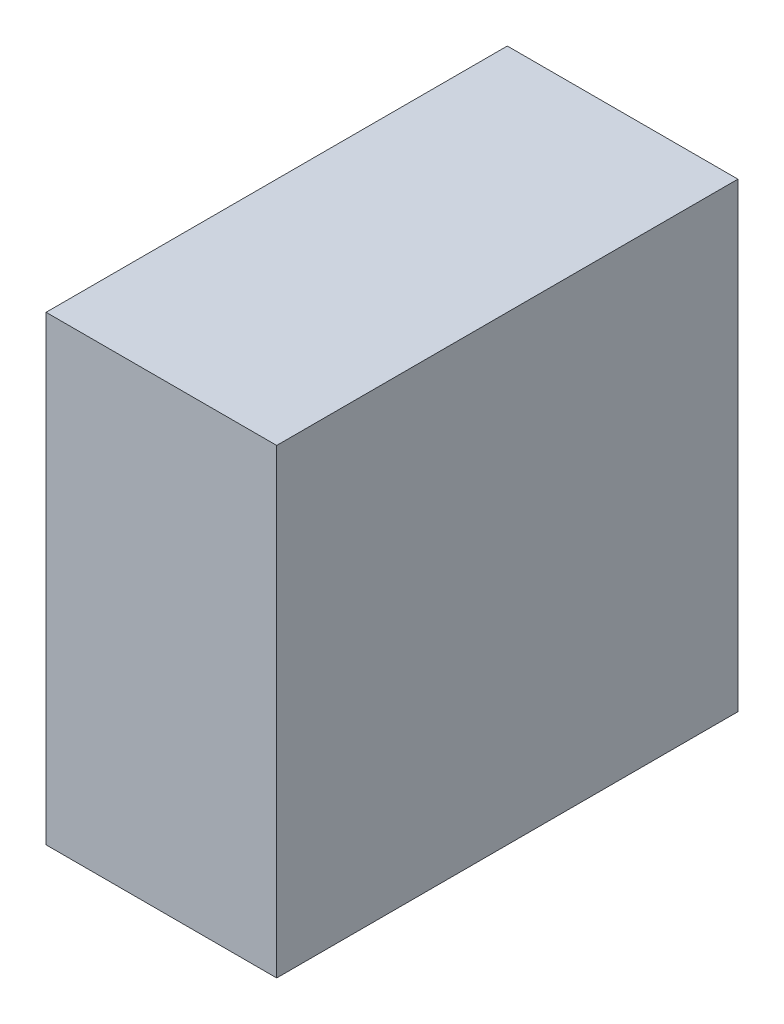
ISO-10303-21;
HEADER;
FILE_DESCRIPTION(('STEP AP214'),'2;1');
FILE_NAME('part.step','',(''),(''),'','','');
FILE_SCHEMA(('AUTOMOTIVE_DESIGN { 1 0 10303 214 1 1 1 1 }'));
ENDSEC;
DATA;
#1=APPLICATION_CONTEXT('core data for automotive mechanical design processes');
#2=APPLICATION_PROTOCOL_DEFINITION('international standard','automotive_design',2000,#1);
#3=PRODUCT_CONTEXT('',#1,'mechanical');
#4=PRODUCT('Part','Part','',(#3));
#5=PRODUCT_RELATED_PRODUCT_CATEGORY('part','',(#4));
#6=PRODUCT_DEFINITION_FORMATION('','',#4);
#7=PRODUCT_DEFINITION_CONTEXT('part definition',#1,'design');
#8=PRODUCT_DEFINITION('design','',#6,#7);
#9=PRODUCT_DEFINITION_SHAPE('','',#8);
#10=(LENGTH_UNIT() NAMED_UNIT(*) SI_UNIT(.MILLI.,.METRE.));
#11=(NAMED_UNIT(*) PLANE_ANGLE_UNIT() SI_UNIT($,.RADIAN.));
#12=(NAMED_UNIT(*) SI_UNIT($,.STERADIAN.) SOLID_ANGLE_UNIT());
#13=UNCERTAINTY_MEASURE_WITH_UNIT(LENGTH_MEASURE(1.E-05),#10,'distance_accuracy_value','');
#14=(GEOMETRIC_REPRESENTATION_CONTEXT(3) GLOBAL_UNCERTAINTY_ASSIGNED_CONTEXT((#13)) GLOBAL_UNIT_ASSIGNED_CONTEXT((#10,
#11,#12)) REPRESENTATION_CONTEXT('',''));
#15=CARTESIAN_POINT('',(0.,0.,0.));
#16=DIRECTION('',(0.,0.,1.));
#17=DIRECTION('',(1.,0.,0.));
#18=AXIS2_PLACEMENT_3D('',#15,#16,#17);
#19=CARTESIAN_POINT('',(0.,0.,40.));
#20=DIRECTION('',(0.,1.,0.));
#21=DIRECTION('',(0.,0.,1.));
#22=AXIS2_PLACEMENT_3D('',#19,#20,#21);
#23=PLANE('',#22);
#24=DIRECTION('',(0.707106781186548,0.,-0.707106781186548));
#25=VECTOR('',#24,1.);
#26=CARTESIAN_POINT('',(10.,0.,10.));
#27=LINE('',#26,#25);
#28=CARTESIAN_POINT('',(0.,0.,20.));
#29=VERTEX_POINT('',#28);
#30=CARTESIAN_POINT('',(20.,0.,0.));
#31=VERTEX_POINT('',#30);
#32=EDGE_CURVE('E93',#29,#31,#27,.T.);
#33=ORIENTED_EDGE('',*,*,#32,.T.);
#34=DIRECTION('',(1.,0.,0.));
#35=VECTOR('',#34,1.);
#36=CARTESIAN_POINT('',(0.,0.,0.));
#37=LINE('',#36,#35);
#38=CARTESIAN_POINT('',(40.,0.,0.));
#39=VERTEX_POINT('',#38);
#40=EDGE_CURVE('E60',#31,#39,#37,.T.);
#41=ORIENTED_EDGE('',*,*,#40,.T.);
#42=DIRECTION('',(0.,0.,-1.));
#43=VECTOR('',#42,1.);
#44=CARTESIAN_POINT('',(40.,0.,40.));
#45=LINE('',#44,#43);
#46=CARTESIAN_POINT('',(40.,0.,40.));
#47=VERTEX_POINT('',#46);
#48=EDGE_CURVE('E41',#47,#39,#45,.T.);
#49=ORIENTED_EDGE('',*,*,#48,.F.);
#50=DIRECTION('',(1.,0.,0.));
#51=VECTOR('',#50,1.);
#52=CARTESIAN_POINT('',(0.,0.,40.));
#53=LINE('',#52,#51);
#54=CARTESIAN_POINT('',(20.,0.,40.));
#55=VERTEX_POINT('',#54);
#56=EDGE_CURVE('E115',#55,#47,#53,.T.);
#57=ORIENTED_EDGE('',*,*,#56,.F.);
#58=DIRECTION('',(0.,0.,1.));
#59=VECTOR('',#58,1.);
#60=CARTESIAN_POINT('',(20.,0.,40.));
#61=LINE('',#60,#59);
#62=CARTESIAN_POINT('',(20.,0.,20.));
#63=VERTEX_POINT('',#62);
#64=EDGE_CURVE('E128',#63,#55,#61,.T.);
#65=ORIENTED_EDGE('',*,*,#64,.F.);
#66=DIRECTION('',(1.,0.,0.));
#67=VECTOR('',#66,1.);
#68=CARTESIAN_POINT('',(0.,0.,20.));
#69=LINE('',#68,#67);
#70=EDGE_CURVE('E97',#29,#63,#69,.T.);
#71=ORIENTED_EDGE('',*,*,#70,.F.);
#72=EDGE_LOOP('',(#33,#41,#49,#57,#65,#71));
#73=FACE_BOUND('',#72,.T.);
#74=ADVANCED_FACE('F33',(#73),#23,.F.);
#75=CARTESIAN_POINT('',(0.,0.,0.));
#76=DIRECTION('',(0.,0.,-1.));
#77=DIRECTION('',(-1.,0.,0.));
#78=AXIS2_PLACEMENT_3D('',#75,#76,#77);
#79=PLANE('',#78);
#80=ORIENTED_EDGE('',*,*,#40,.F.);
#81=DIRECTION('',(0.,-1.,0.));
#82=VECTOR('',#81,1.);
#83=CARTESIAN_POINT('',(20.,40.,0.));
#84=LINE('',#83,#82);
#85=CARTESIAN_POINT('',(20.,40.,0.));
#86=VERTEX_POINT('',#85);
#87=EDGE_CURVE('E92',#86,#31,#84,.T.);
#88=ORIENTED_EDGE('',*,*,#87,.F.);
#89=DIRECTION('',(-1.,0.,0.));
#90=VECTOR('',#89,1.);
#91=CARTESIAN_POINT('',(0.,40.,0.));
#92=LINE('',#91,#90);
#93=CARTESIAN_POINT('',(40.,40.,0.));
#94=VERTEX_POINT('',#93);
#95=EDGE_CURVE('E104',#94,#86,#92,.T.);
#96=ORIENTED_EDGE('',*,*,#95,.F.);
#97=DIRECTION('',(0.,1.,0.));
#98=VECTOR('',#97,1.);
#99=CARTESIAN_POINT('',(40.,0.,0.));
#100=LINE('',#99,#98);
#101=EDGE_CURVE('E116',#39,#94,#100,.T.);
#102=ORIENTED_EDGE('',*,*,#101,.F.);
#103=EDGE_LOOP('',(#80,#88,#96,#102));
#104=FACE_BOUND('',#103,.T.);
#105=ADVANCED_FACE('F101',(#104),#79,.T.);
#106=CARTESIAN_POINT('',(0.,0.,0.));
#107=DIRECTION('',(0.894427190999916,-0.447213595499958,0.));
#108=DIRECTION('',(0.447213595499958,0.894427190999916,0.));
#109=AXIS2_PLACEMENT_3D('',#106,#107,#108);
#110=PLANE('',#109);
#111=DIRECTION('',(0.408248290463863,0.816496580927726,-0.408248290463863));
#112=VECTOR('',#111,1.);
#113=CARTESIAN_POINT('',(3.33333333333333,6.66666666666667,16.6666666666667));
#114=LINE('',#113,#112);
#115=EDGE_CURVE('E89',#29,#86,#114,.T.);
#116=ORIENTED_EDGE('',*,*,#115,.F.);
#117=DIRECTION('',(0.447213595499958,0.894427190999916,0.));
#118=VECTOR('',#117,1.);
#119=CARTESIAN_POINT('',(0.,0.,20.));
#120=LINE('',#119,#118);
#121=CARTESIAN_POINT('',(20.,40.,20.));
#122=VERTEX_POINT('',#121);
#123=EDGE_CURVE('E11',#29,#122,#120,.T.);
#124=ORIENTED_EDGE('',*,*,#123,.T.);
#125=DIRECTION('',(0.,0.,1.));
#126=VECTOR('',#125,1.);
#127=CARTESIAN_POINT('',(20.,40.,0.));
#128=LINE('',#127,#126);
#129=EDGE_CURVE('E107',#86,#122,#128,.T.);
#130=ORIENTED_EDGE('',*,*,#129,.F.);
#131=EDGE_LOOP('',(#116,#124,#130));
#132=FACE_BOUND('',#131,.T.);
#133=ADVANCED_FACE('F108',(#132),#110,.F.);
#134=CARTESIAN_POINT('',(40.,0.,40.));
#135=DIRECTION('',(-1.,0.,0.));
#136=DIRECTION('',(0.,0.,1.));
#137=AXIS2_PLACEMENT_3D('',#134,#135,#136);
#138=PLANE('',#137);
#139=ORIENTED_EDGE('',*,*,#101,.T.);
#140=DIRECTION('',(0.,0.,-1.));
#141=VECTOR('',#140,1.);
#142=CARTESIAN_POINT('',(40.,40.,40.));
#143=LINE('',#142,#141);
#144=CARTESIAN_POINT('',(40.,40.,40.));
#145=VERTEX_POINT('',#144);
#146=EDGE_CURVE('E114',#145,#94,#143,.T.);
#147=ORIENTED_EDGE('',*,*,#146,.F.);
#148=DIRECTION('',(0.,1.,0.));
#149=VECTOR('',#148,1.);
#150=CARTESIAN_POINT('',(40.,0.,40.));
#151=LINE('',#150,#149);
#152=EDGE_CURVE('E49',#47,#145,#151,.T.);
#153=ORIENTED_EDGE('',*,*,#152,.F.);
#154=ORIENTED_EDGE('',*,*,#48,.T.);
#155=EDGE_LOOP('',(#139,#147,#153,#154));
#156=FACE_BOUND('',#155,.T.);
#157=ADVANCED_FACE('F124',(#156),#138,.F.);
#158=CARTESIAN_POINT('',(0.,40.,40.));
#159=DIRECTION('',(0.,-1.,0.));
#160=DIRECTION('',(0.,0.,-1.));
#161=AXIS2_PLACEMENT_3D('',#158,#159,#160);
#162=PLANE('',#161);
#163=ORIENTED_EDGE('',*,*,#95,.T.);
#164=ORIENTED_EDGE('',*,*,#129,.T.);
#165=DIRECTION('',(0.,0.,1.));
#166=VECTOR('',#165,1.);
#167=CARTESIAN_POINT('',(20.,40.,40.));
#168=LINE('',#167,#166);
#169=CARTESIAN_POINT('',(20.,40.,40.));
#170=VERTEX_POINT('',#169);
#171=EDGE_CURVE('E132',#122,#170,#168,.T.);
#172=ORIENTED_EDGE('',*,*,#171,.T.);
#173=DIRECTION('',(-1.,0.,0.));
#174=VECTOR('',#173,1.);
#175=CARTESIAN_POINT('',(0.,40.,40.));
#176=LINE('',#175,#174);
#177=EDGE_CURVE('E122',#145,#170,#176,.T.);
#178=ORIENTED_EDGE('',*,*,#177,.F.);
#179=ORIENTED_EDGE('',*,*,#146,.T.);
#180=EDGE_LOOP('',(#163,#164,#172,#178,#179));
#181=FACE_BOUND('',#180,.T.);
#182=ADVANCED_FACE('F112',(#181),#162,.F.);
#183=CARTESIAN_POINT('',(0.,0.,40.));
#184=DIRECTION('',(0.,0.,-1.));
#185=DIRECTION('',(-1.,0.,0.));
#186=AXIS2_PLACEMENT_3D('',#183,#184,#185);
#187=PLANE('',#186);
#188=ORIENTED_EDGE('',*,*,#177,.T.);
#189=DIRECTION('',(0.,-1.,0.));
#190=VECTOR('',#189,1.);
#191=CARTESIAN_POINT('',(20.,40.,40.));
#192=LINE('',#191,#190);
#193=EDGE_CURVE('E69',#170,#55,#192,.T.);
#194=ORIENTED_EDGE('',*,*,#193,.T.);
#195=ORIENTED_EDGE('',*,*,#56,.T.);
#196=ORIENTED_EDGE('',*,*,#152,.T.);
#197=EDGE_LOOP('',(#188,#194,#195,#196));
#198=FACE_BOUND('',#197,.T.);
#199=ADVANCED_FACE('F129',(#198),#187,.F.);
#200=CARTESIAN_POINT('',(0.,40.,20.));
#201=DIRECTION('',(0.,0.,-1.));
#202=DIRECTION('',(-1.,0.,0.));
#203=AXIS2_PLACEMENT_3D('',#200,#201,#202);
#204=PLANE('',#203);
#205=ORIENTED_EDGE('',*,*,#70,.T.);
#206=DIRECTION('',(0.,-1.,0.));
#207=VECTOR('',#206,1.);
#208=CARTESIAN_POINT('',(20.,40.,20.));
#209=LINE('',#208,#207);
#210=EDGE_CURVE('E130',#122,#63,#209,.T.);
#211=ORIENTED_EDGE('',*,*,#210,.F.);
#212=ORIENTED_EDGE('',*,*,#123,.F.);
#213=EDGE_LOOP('',(#205,#211,#212));
#214=FACE_BOUND('',#213,.T.);
#215=ADVANCED_FACE('F142',(#214),#204,.F.);
#216=CARTESIAN_POINT('',(20.,40.,40.));
#217=DIRECTION('',(1.,0.,0.));
#218=DIRECTION('',(0.,0.,-1.));
#219=AXIS2_PLACEMENT_3D('',#216,#217,#218);
#220=PLANE('',#219);
#221=ORIENTED_EDGE('',*,*,#64,.T.);
#222=ORIENTED_EDGE('',*,*,#193,.F.);
#223=ORIENTED_EDGE('',*,*,#171,.F.);
#224=ORIENTED_EDGE('',*,*,#210,.T.);
#225=EDGE_LOOP('',(#221,#222,#223,#224));
#226=FACE_BOUND('',#225,.T.);
#227=ADVANCED_FACE('F143',(#226),#220,.F.);
#228=CARTESIAN_POINT('',(10.,40.,10.));
#229=DIRECTION('',(-0.707106781186548,0.,-0.707106781186548));
#230=DIRECTION('',(-0.707106781186548,0.,0.707106781186548));
#231=AXIS2_PLACEMENT_3D('',#228,#229,#230);
#232=PLANE('',#231);
#233=ORIENTED_EDGE('',*,*,#115,.T.);
#234=ORIENTED_EDGE('',*,*,#87,.T.);
#235=ORIENTED_EDGE('',*,*,#32,.F.);
#236=EDGE_LOOP('',(#233,#234,#235));
#237=FACE_BOUND('',#236,.T.);
#238=ADVANCED_FACE('F91',(#237),#232,.T.);
#239=CLOSED_SHELL('',(#74,#105,#133,#157,#182,#199,#215,#227,#238));
#240=MANIFOLD_SOLID_BREP('B2',#239);
#241=ADVANCED_BREP_SHAPE_REPRESENTATION('',(#18,#240),#14);
#242=SHAPE_DEFINITION_REPRESENTATION(#9,#241);
ENDSEC;
END-ISO-10303-21;
